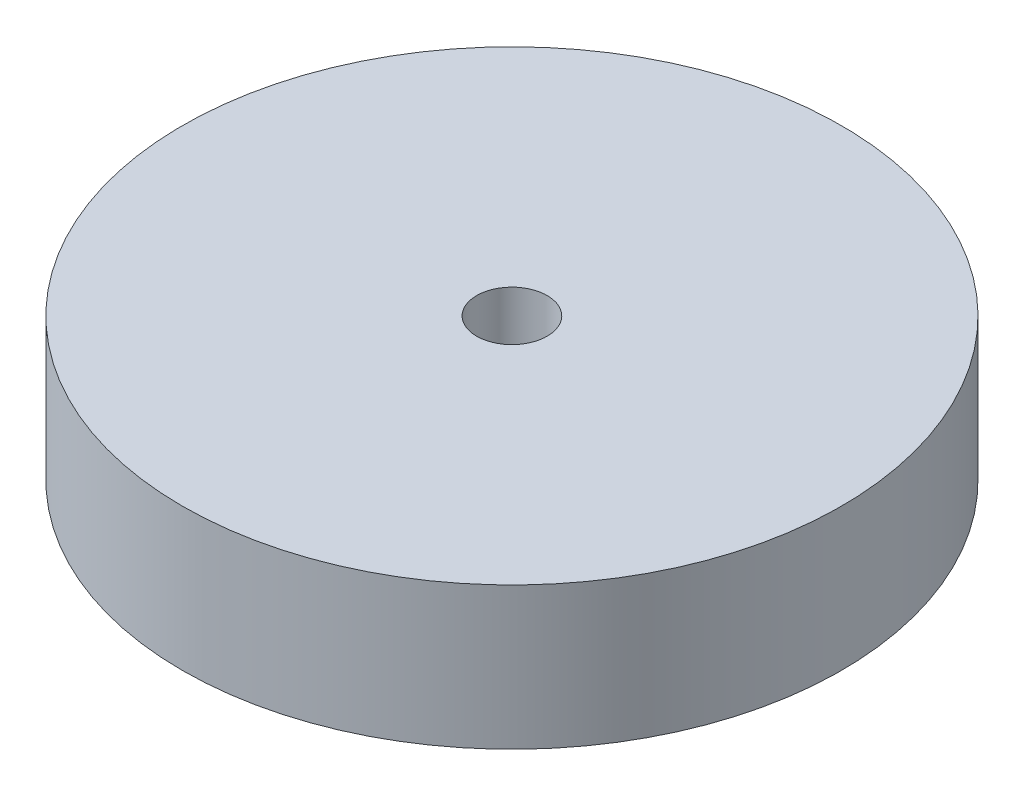
ISO-10303-21;
HEADER;
FILE_DESCRIPTION(('STEP AP214'),'2;1');
FILE_NAME('part.step','',(''),(''),'','','');
FILE_SCHEMA(('AUTOMOTIVE_DESIGN { 1 0 10303 214 1 1 1 1 }'));
ENDSEC;
DATA;
#1=APPLICATION_CONTEXT('core data for automotive mechanical design processes');
#2=APPLICATION_PROTOCOL_DEFINITION('international standard','automotive_design',2000,#1);
#3=PRODUCT_CONTEXT('',#1,'mechanical');
#4=PRODUCT('Part','Part','',(#3));
#5=PRODUCT_RELATED_PRODUCT_CATEGORY('part','',(#4));
#6=PRODUCT_DEFINITION_FORMATION('','',#4);
#7=PRODUCT_DEFINITION_CONTEXT('part definition',#1,'design');
#8=PRODUCT_DEFINITION('design','',#6,#7);
#9=PRODUCT_DEFINITION_SHAPE('','',#8);
#10=(LENGTH_UNIT() NAMED_UNIT(*) SI_UNIT(.MILLI.,.METRE.));
#11=(NAMED_UNIT(*) PLANE_ANGLE_UNIT() SI_UNIT($,.RADIAN.));
#12=(NAMED_UNIT(*) SI_UNIT($,.STERADIAN.) SOLID_ANGLE_UNIT());
#13=UNCERTAINTY_MEASURE_WITH_UNIT(LENGTH_MEASURE(1.E-05),#10,'distance_accuracy_value','');
#14=(GEOMETRIC_REPRESENTATION_CONTEXT(3) GLOBAL_UNCERTAINTY_ASSIGNED_CONTEXT((#13)) GLOBAL_UNIT_ASSIGNED_CONTEXT((#10,
#11,#12)) REPRESENTATION_CONTEXT('',''));
#15=CARTESIAN_POINT('',(0.,0.,0.));
#16=DIRECTION('',(0.,0.,1.));
#17=DIRECTION('',(1.,0.,0.));
#18=AXIS2_PLACEMENT_3D('',#15,#16,#17);
#19=CARTESIAN_POINT('',(0.,86.36,0.));
#20=DIRECTION('',(0.,1.,0.));
#21=DIRECTION('',(0.,0.,1.));
#22=AXIS2_PLACEMENT_3D('',#19,#20,#21);
#23=PLANE('',#22);
#24=CARTESIAN_POINT('',(0.,86.36,0.));
#25=DIRECTION('',(0.,1.,0.));
#26=DIRECTION('',(0.,0.,1.));
#27=AXIS2_PLACEMENT_3D('',#24,#25,#26);
#28=CIRCLE('',#27,200.);
#29=CARTESIAN_POINT('',(0.,86.36,200.));
#30=VERTEX_POINT('',#29);
#31=EDGE_CURVE('E10',#30,#30,#28,.T.);
#32=ORIENTED_EDGE('',*,*,#31,.T.);
#33=EDGE_LOOP('',(#32));
#34=FACE_BOUND('',#33,.T.);
#35=CARTESIAN_POINT('',(0.,86.36,0.));
#36=DIRECTION('',(0.,1.,0.));
#37=DIRECTION('',(0.,0.,1.));
#38=AXIS2_PLACEMENT_3D('',#35,#36,#37);
#39=CIRCLE('',#38,21.39);
#40=CARTESIAN_POINT('',(0.,86.36,21.39));
#41=VERTEX_POINT('',#40);
#42=EDGE_CURVE('E48',#41,#41,#39,.T.);
#43=ORIENTED_EDGE('',*,*,#42,.F.);
#44=EDGE_LOOP('',(#43));
#45=FACE_BOUND('',#44,.T.);
#46=ADVANCED_FACE('F35',(#34,#45),#23,.T.);
#47=CARTESIAN_POINT('',(0.,0.,0.));
#48=DIRECTION('',(0.,1.,0.));
#49=DIRECTION('',(0.,0.,1.));
#50=AXIS2_PLACEMENT_3D('',#47,#48,#49);
#51=PLANE('',#50);
#52=CARTESIAN_POINT('',(0.,0.,0.));
#53=DIRECTION('',(0.,1.,0.));
#54=DIRECTION('',(0.,0.,1.));
#55=AXIS2_PLACEMENT_3D('',#52,#53,#54);
#56=CIRCLE('',#55,200.);
#57=CARTESIAN_POINT('',(0.,0.,200.));
#58=VERTEX_POINT('',#57);
#59=EDGE_CURVE('E39',#58,#58,#56,.T.);
#60=ORIENTED_EDGE('',*,*,#59,.F.);
#61=EDGE_LOOP('',(#60));
#62=FACE_BOUND('',#61,.T.);
#63=CARTESIAN_POINT('',(0.,0.,0.));
#64=DIRECTION('',(0.,1.,0.));
#65=DIRECTION('',(0.,0.,1.));
#66=AXIS2_PLACEMENT_3D('',#63,#64,#65);
#67=CIRCLE('',#66,21.39);
#68=CARTESIAN_POINT('',(0.,0.,21.39));
#69=VERTEX_POINT('',#68);
#70=EDGE_CURVE('E50',#69,#69,#67,.T.);
#71=ORIENTED_EDGE('',*,*,#70,.T.);
#72=EDGE_LOOP('',(#71));
#73=FACE_BOUND('',#72,.T.);
#74=ADVANCED_FACE('F62',(#62,#73),#51,.F.);
#75=CARTESIAN_POINT('',(0.,86.36,0.));
#76=DIRECTION('',(0.,-1.,0.));
#77=DIRECTION('',(0.,0.,-1.));
#78=AXIS2_PLACEMENT_3D('',#75,#76,#77);
#79=CYLINDRICAL_SURFACE('',#78,200.);
#80=ORIENTED_EDGE('',*,*,#31,.F.);
#81=EDGE_LOOP('',(#80));
#82=FACE_BOUND('',#81,.T.);
#83=ORIENTED_EDGE('',*,*,#59,.T.);
#84=EDGE_LOOP('',(#83));
#85=FACE_BOUND('',#84,.T.);
#86=ADVANCED_FACE('F37',(#82,#85),#79,.T.);
#87=CARTESIAN_POINT('',(0.,86.36,0.));
#88=DIRECTION('',(0.,-1.,0.));
#89=DIRECTION('',(0.,0.,-1.));
#90=AXIS2_PLACEMENT_3D('',#87,#88,#89);
#91=CYLINDRICAL_SURFACE('',#90,21.39);
#92=ORIENTED_EDGE('',*,*,#42,.T.);
#93=EDGE_LOOP('',(#92));
#94=FACE_BOUND('',#93,.T.);
#95=ORIENTED_EDGE('',*,*,#70,.F.);
#96=EDGE_LOOP('',(#95));
#97=FACE_BOUND('',#96,.T.);
#98=ADVANCED_FACE('F58',(#94,#97),#91,.F.);
#99=CLOSED_SHELL('',(#46,#74,#86,#98));
#100=MANIFOLD_SOLID_BREP('B2',#99);
#101=ADVANCED_BREP_SHAPE_REPRESENTATION('',(#18,#100),#14);
#102=SHAPE_DEFINITION_REPRESENTATION(#9,#101);
ENDSEC;
END-ISO-10303-21;
